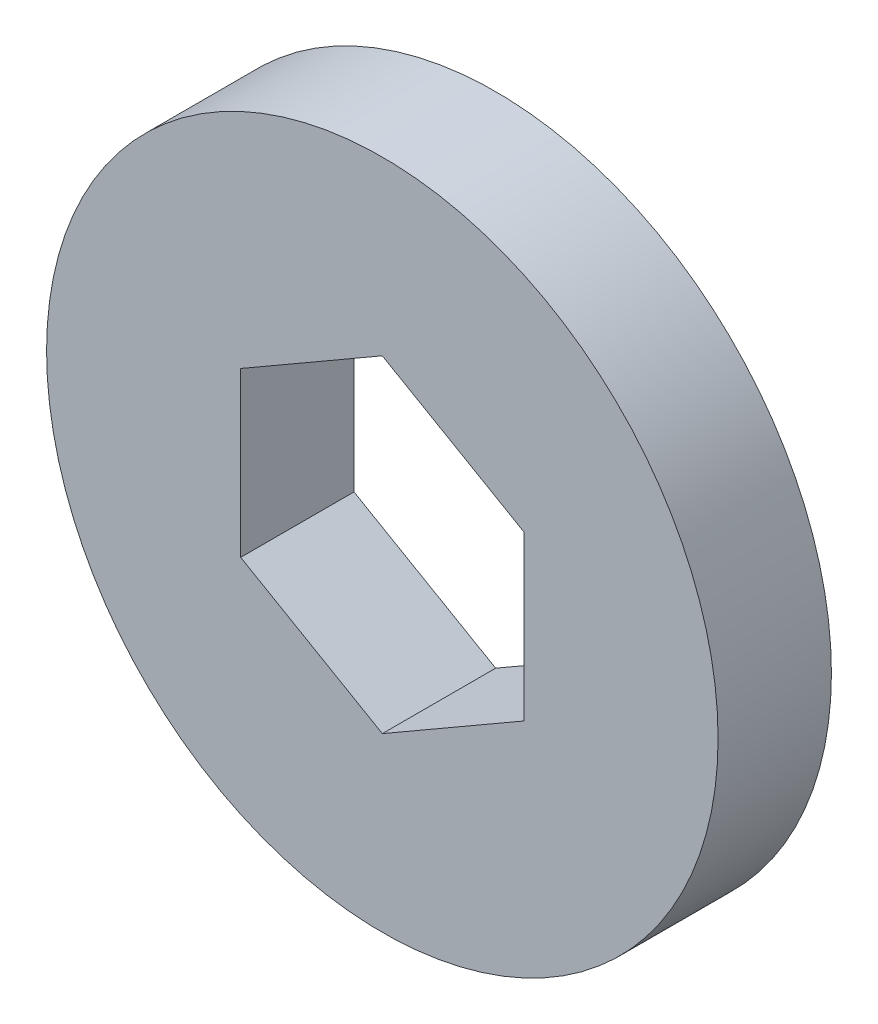
ISO-10303-21;
HEADER;
FILE_DESCRIPTION(('STEP AP214'),'2;1');
FILE_NAME('part.step','',(''),(''),'','','');
FILE_SCHEMA(('AUTOMOTIVE_DESIGN { 1 0 10303 214 1 1 1 1 }'));
ENDSEC;
DATA;
#1=APPLICATION_CONTEXT('core data for automotive mechanical design processes');
#2=APPLICATION_PROTOCOL_DEFINITION('international standard','automotive_design',2000,#1);
#3=PRODUCT_CONTEXT('',#1,'mechanical');
#4=PRODUCT('Part','Part','',(#3));
#5=PRODUCT_RELATED_PRODUCT_CATEGORY('part','',(#4));
#6=PRODUCT_DEFINITION_FORMATION('','',#4);
#7=PRODUCT_DEFINITION_CONTEXT('part definition',#1,'design');
#8=PRODUCT_DEFINITION('design','',#6,#7);
#9=PRODUCT_DEFINITION_SHAPE('','',#8);
#10=(LENGTH_UNIT() NAMED_UNIT(*) SI_UNIT(.MILLI.,.METRE.));
#11=(NAMED_UNIT(*) PLANE_ANGLE_UNIT() SI_UNIT($,.RADIAN.));
#12=(NAMED_UNIT(*) SI_UNIT($,.STERADIAN.) SOLID_ANGLE_UNIT());
#13=UNCERTAINTY_MEASURE_WITH_UNIT(LENGTH_MEASURE(1.E-05),#10,'distance_accuracy_value','');
#14=(GEOMETRIC_REPRESENTATION_CONTEXT(3) GLOBAL_UNCERTAINTY_ASSIGNED_CONTEXT((#13)) GLOBAL_UNIT_ASSIGNED_CONTEXT((#10,
#11,#12)) REPRESENTATION_CONTEXT('',''));
#15=CARTESIAN_POINT('',(0.,0.,0.));
#16=DIRECTION('',(0.,0.,1.));
#17=DIRECTION('',(1.,0.,0.));
#18=AXIS2_PLACEMENT_3D('',#15,#16,#17);
#19=CARTESIAN_POINT('',(0.,0.,4.));
#20=DIRECTION('',(0.,0.,-1.));
#21=DIRECTION('',(-1.,0.,0.));
#22=AXIS2_PLACEMENT_3D('',#19,#20,#21);
#23=CYLINDRICAL_SURFACE('',#22,11.85);
#24=CARTESIAN_POINT('',(0.,0.,4.));
#25=DIRECTION('',(0.,0.,1.));
#26=DIRECTION('',(1.,0.,0.));
#27=AXIS2_PLACEMENT_3D('',#24,#25,#26);
#28=CIRCLE('',#27,11.85);
#29=CARTESIAN_POINT('',(11.85,0.,4.));
#30=VERTEX_POINT('',#29);
#31=EDGE_CURVE('E11',#30,#30,#28,.T.);
#32=ORIENTED_EDGE('',*,*,#31,.F.);
#33=EDGE_LOOP('',(#32));
#34=FACE_BOUND('',#33,.T.);
#35=CARTESIAN_POINT('',(0.,0.,0.));
#36=DIRECTION('',(0.,0.,1.));
#37=DIRECTION('',(1.,0.,0.));
#38=AXIS2_PLACEMENT_3D('',#35,#36,#37);
#39=CIRCLE('',#38,11.85);
#40=CARTESIAN_POINT('',(11.85,0.,0.));
#41=VERTEX_POINT('',#40);
#42=EDGE_CURVE('E39',#41,#41,#39,.T.);
#43=ORIENTED_EDGE('',*,*,#42,.T.);
#44=EDGE_LOOP('',(#43));
#45=FACE_BOUND('',#44,.T.);
#46=ADVANCED_FACE('F36',(#34,#45),#23,.T.);
#47=CARTESIAN_POINT('',(0.,0.,4.));
#48=DIRECTION('',(0.,0.,1.));
#49=DIRECTION('',(1.,0.,0.));
#50=AXIS2_PLACEMENT_3D('',#47,#48,#49);
#51=PLANE('',#50);
#52=DIRECTION('',(0.866025403784439,0.5,0.));
#53=VECTOR('',#52,1.);
#54=CARTESIAN_POINT('',(-5.,2.88675134594813,4.));
#55=LINE('',#54,#53);
#56=CARTESIAN_POINT('',(-5.,2.88675134594813,4.));
#57=VERTEX_POINT('',#56);
#58=CARTESIAN_POINT('',(0.,5.77350269189626,4.));
#59=VERTEX_POINT('',#58);
#60=EDGE_CURVE('E90',#57,#59,#55,.T.);
#61=ORIENTED_EDGE('',*,*,#60,.T.);
#62=DIRECTION('',(0.866025403784439,-0.5,0.));
#63=VECTOR('',#62,1.);
#64=CARTESIAN_POINT('',(0.,5.77350269189626,4.));
#65=LINE('',#64,#63);
#66=CARTESIAN_POINT('',(5.,2.88675134594813,4.));
#67=VERTEX_POINT('',#66);
#68=EDGE_CURVE('E99',#59,#67,#65,.T.);
#69=ORIENTED_EDGE('',*,*,#68,.T.);
#70=DIRECTION('',(0.,-1.,0.));
#71=VECTOR('',#70,1.);
#72=CARTESIAN_POINT('',(5.,2.88675134594813,4.));
#73=LINE('',#72,#71);
#74=CARTESIAN_POINT('',(5.,-2.88675134594813,4.));
#75=VERTEX_POINT('',#74);
#76=EDGE_CURVE('E50',#67,#75,#73,.T.);
#77=ORIENTED_EDGE('',*,*,#76,.T.);
#78=DIRECTION('',(-0.866025403784439,-0.5,0.));
#79=VECTOR('',#78,1.);
#80=CARTESIAN_POINT('',(5.,-2.88675134594813,4.));
#81=LINE('',#80,#79);
#82=CARTESIAN_POINT('',(0.,-5.77350269189626,4.));
#83=VERTEX_POINT('',#82);
#84=EDGE_CURVE('E114',#75,#83,#81,.T.);
#85=ORIENTED_EDGE('',*,*,#84,.T.);
#86=DIRECTION('',(-0.866025403784439,0.5,0.));
#87=VECTOR('',#86,1.);
#88=CARTESIAN_POINT('',(0.,-5.77350269189626,4.));
#89=LINE('',#88,#87);
#90=CARTESIAN_POINT('',(-5.,-2.88675134594813,4.));
#91=VERTEX_POINT('',#90);
#92=EDGE_CURVE('E117',#83,#91,#89,.T.);
#93=ORIENTED_EDGE('',*,*,#92,.T.);
#94=DIRECTION('',(0.,1.,0.));
#95=VECTOR('',#94,1.);
#96=CARTESIAN_POINT('',(-5.,-2.88675134594813,4.));
#97=LINE('',#96,#95);
#98=EDGE_CURVE('E96',#91,#57,#97,.T.);
#99=ORIENTED_EDGE('',*,*,#98,.T.);
#100=EDGE_LOOP('',(#61,#69,#77,#85,#93,#99));
#101=FACE_BOUND('',#100,.T.);
#102=ORIENTED_EDGE('',*,*,#31,.T.);
#103=EDGE_LOOP('',(#102));
#104=FACE_BOUND('',#103,.T.);
#105=ADVANCED_FACE('F103',(#101,#104),#51,.T.);
#106=CARTESIAN_POINT('',(0.,0.,0.));
#107=DIRECTION('',(0.,0.,1.));
#108=DIRECTION('',(1.,0.,0.));
#109=AXIS2_PLACEMENT_3D('',#106,#107,#108);
#110=PLANE('',#109);
#111=DIRECTION('',(0.866025403784439,-0.5,0.));
#112=VECTOR('',#111,1.);
#113=CARTESIAN_POINT('',(0.,5.77350269189626,0.));
#114=LINE('',#113,#112);
#115=CARTESIAN_POINT('',(0.,5.77350269189626,0.));
#116=VERTEX_POINT('',#115);
#117=CARTESIAN_POINT('',(5.,2.88675134594813,0.));
#118=VERTEX_POINT('',#117);
#119=EDGE_CURVE('E121',#116,#118,#114,.T.);
#120=ORIENTED_EDGE('',*,*,#119,.F.);
#121=DIRECTION('',(0.866025403784439,0.5,0.));
#122=VECTOR('',#121,1.);
#123=CARTESIAN_POINT('',(-5.,2.88675134594813,0.));
#124=LINE('',#123,#122);
#125=CARTESIAN_POINT('',(-5.,2.88675134594813,0.));
#126=VERTEX_POINT('',#125);
#127=EDGE_CURVE('E58',#126,#116,#124,.T.);
#128=ORIENTED_EDGE('',*,*,#127,.F.);
#129=DIRECTION('',(0.,1.,0.));
#130=VECTOR('',#129,1.);
#131=CARTESIAN_POINT('',(-5.,-2.88675134594813,0.));
#132=LINE('',#131,#130);
#133=CARTESIAN_POINT('',(-5.,-2.88675134594813,0.));
#134=VERTEX_POINT('',#133);
#135=EDGE_CURVE('E107',#134,#126,#132,.T.);
#136=ORIENTED_EDGE('',*,*,#135,.F.);
#137=DIRECTION('',(-0.866025403784439,0.5,0.));
#138=VECTOR('',#137,1.);
#139=CARTESIAN_POINT('',(0.,-5.77350269189626,0.));
#140=LINE('',#139,#138);
#141=CARTESIAN_POINT('',(0.,-5.77350269189626,0.));
#142=VERTEX_POINT('',#141);
#143=EDGE_CURVE('E110',#142,#134,#140,.T.);
#144=ORIENTED_EDGE('',*,*,#143,.F.);
#145=DIRECTION('',(-0.866025403784439,-0.5,0.));
#146=VECTOR('',#145,1.);
#147=CARTESIAN_POINT('',(5.,-2.88675134594813,0.));
#148=LINE('',#147,#146);
#149=CARTESIAN_POINT('',(5.,-2.88675134594813,0.));
#150=VERTEX_POINT('',#149);
#151=EDGE_CURVE('E126',#150,#142,#148,.T.);
#152=ORIENTED_EDGE('',*,*,#151,.F.);
#153=DIRECTION('',(0.,-1.,0.));
#154=VECTOR('',#153,1.);
#155=CARTESIAN_POINT('',(5.,2.88675134594813,0.));
#156=LINE('',#155,#154);
#157=EDGE_CURVE('E123',#118,#150,#156,.T.);
#158=ORIENTED_EDGE('',*,*,#157,.F.);
#159=EDGE_LOOP('',(#120,#128,#136,#144,#152,#158));
#160=FACE_BOUND('',#159,.T.);
#161=ORIENTED_EDGE('',*,*,#42,.F.);
#162=EDGE_LOOP('',(#161));
#163=FACE_BOUND('',#162,.T.);
#164=ADVANCED_FACE('F143',(#160,#163),#110,.F.);
#165=CARTESIAN_POINT('',(-5.,2.88675134594813,4.));
#166=DIRECTION('',(-0.5,0.866025403784439,0.));
#167=DIRECTION('',(-0.866025403784439,-0.5,0.));
#168=AXIS2_PLACEMENT_3D('',#165,#166,#167);
#169=PLANE('',#168);
#170=ORIENTED_EDGE('',*,*,#127,.T.);
#171=DIRECTION('',(0.,0.,-1.));
#172=VECTOR('',#171,1.);
#173=CARTESIAN_POINT('',(0.,5.77350269189626,4.));
#174=LINE('',#173,#172);
#175=EDGE_CURVE('E86',#59,#116,#174,.T.);
#176=ORIENTED_EDGE('',*,*,#175,.F.);
#177=ORIENTED_EDGE('',*,*,#60,.F.);
#178=DIRECTION('',(0.,0.,-1.));
#179=VECTOR('',#178,1.);
#180=CARTESIAN_POINT('',(-5.,2.88675134594813,4.));
#181=LINE('',#180,#179);
#182=EDGE_CURVE('E131',#57,#126,#181,.T.);
#183=ORIENTED_EDGE('',*,*,#182,.T.);
#184=EDGE_LOOP('',(#170,#176,#177,#183));
#185=FACE_BOUND('',#184,.T.);
#186=ADVANCED_FACE('F88',(#185),#169,.F.);
#187=CARTESIAN_POINT('',(-5.,-2.88675134594813,4.));
#188=DIRECTION('',(-1.,0.,0.));
#189=DIRECTION('',(0.,0.,1.));
#190=AXIS2_PLACEMENT_3D('',#187,#188,#189);
#191=PLANE('',#190);
#192=ORIENTED_EDGE('',*,*,#135,.T.);
#193=ORIENTED_EDGE('',*,*,#182,.F.);
#194=ORIENTED_EDGE('',*,*,#98,.F.);
#195=DIRECTION('',(0.,0.,-1.));
#196=VECTOR('',#195,1.);
#197=CARTESIAN_POINT('',(-5.,-2.88675134594813,4.));
#198=LINE('',#197,#196);
#199=EDGE_CURVE('E133',#91,#134,#198,.T.);
#200=ORIENTED_EDGE('',*,*,#199,.T.);
#201=EDGE_LOOP('',(#192,#193,#194,#200));
#202=FACE_BOUND('',#201,.T.);
#203=ADVANCED_FACE('F154',(#202),#191,.F.);
#204=CARTESIAN_POINT('',(0.,-5.77350269189626,4.));
#205=DIRECTION('',(-0.5,-0.866025403784439,0.));
#206=DIRECTION('',(0.866025403784439,-0.5,0.));
#207=AXIS2_PLACEMENT_3D('',#204,#205,#206);
#208=PLANE('',#207);
#209=ORIENTED_EDGE('',*,*,#143,.T.);
#210=ORIENTED_EDGE('',*,*,#199,.F.);
#211=ORIENTED_EDGE('',*,*,#92,.F.);
#212=DIRECTION('',(0.,0.,-1.));
#213=VECTOR('',#212,1.);
#214=CARTESIAN_POINT('',(0.,-5.77350269189626,4.));
#215=LINE('',#214,#213);
#216=EDGE_CURVE('E135',#83,#142,#215,.T.);
#217=ORIENTED_EDGE('',*,*,#216,.T.);
#218=EDGE_LOOP('',(#209,#210,#211,#217));
#219=FACE_BOUND('',#218,.T.);
#220=ADVANCED_FACE('F152',(#219),#208,.F.);
#221=CARTESIAN_POINT('',(5.,-2.88675134594813,4.));
#222=DIRECTION('',(0.5,-0.866025403784439,0.));
#223=DIRECTION('',(0.866025403784439,0.5,0.));
#224=AXIS2_PLACEMENT_3D('',#221,#222,#223);
#225=PLANE('',#224);
#226=ORIENTED_EDGE('',*,*,#151,.T.);
#227=ORIENTED_EDGE('',*,*,#216,.F.);
#228=ORIENTED_EDGE('',*,*,#84,.F.);
#229=DIRECTION('',(0.,0.,-1.));
#230=VECTOR('',#229,1.);
#231=CARTESIAN_POINT('',(5.,-2.88675134594813,4.));
#232=LINE('',#231,#230);
#233=EDGE_CURVE('E137',#75,#150,#232,.T.);
#234=ORIENTED_EDGE('',*,*,#233,.T.);
#235=EDGE_LOOP('',(#226,#227,#228,#234));
#236=FACE_BOUND('',#235,.T.);
#237=ADVANCED_FACE('F148',(#236),#225,.F.);
#238=CARTESIAN_POINT('',(5.,2.88675134594813,4.));
#239=DIRECTION('',(1.,0.,0.));
#240=DIRECTION('',(0.,0.,-1.));
#241=AXIS2_PLACEMENT_3D('',#238,#239,#240);
#242=PLANE('',#241);
#243=ORIENTED_EDGE('',*,*,#157,.T.);
#244=ORIENTED_EDGE('',*,*,#233,.F.);
#245=ORIENTED_EDGE('',*,*,#76,.F.);
#246=DIRECTION('',(0.,0.,-1.));
#247=VECTOR('',#246,1.);
#248=CARTESIAN_POINT('',(5.,2.88675134594813,4.));
#249=LINE('',#248,#247);
#250=EDGE_CURVE('E95',#67,#118,#249,.T.);
#251=ORIENTED_EDGE('',*,*,#250,.T.);
#252=EDGE_LOOP('',(#243,#244,#245,#251));
#253=FACE_BOUND('',#252,.T.);
#254=ADVANCED_FACE('F139',(#253),#242,.F.);
#255=CARTESIAN_POINT('',(0.,5.77350269189626,4.));
#256=DIRECTION('',(0.5,0.866025403784439,0.));
#257=DIRECTION('',(-0.866025403784439,0.5,0.));
#258=AXIS2_PLACEMENT_3D('',#255,#256,#257);
#259=PLANE('',#258);
#260=ORIENTED_EDGE('',*,*,#119,.T.);
#261=ORIENTED_EDGE('',*,*,#250,.F.);
#262=ORIENTED_EDGE('',*,*,#68,.F.);
#263=ORIENTED_EDGE('',*,*,#175,.T.);
#264=EDGE_LOOP('',(#260,#261,#262,#263));
#265=FACE_BOUND('',#264,.T.);
#266=ADVANCED_FACE('F100',(#265),#259,.F.);
#267=CLOSED_SHELL('',(#46,#105,#164,#186,#203,#220,#237,#254,#266));
#268=MANIFOLD_SOLID_BREP('B2',#267);
#269=ADVANCED_BREP_SHAPE_REPRESENTATION('',(#18,#268),#14);
#270=SHAPE_DEFINITION_REPRESENTATION(#9,#269);
ENDSEC;
END-ISO-10303-21;
